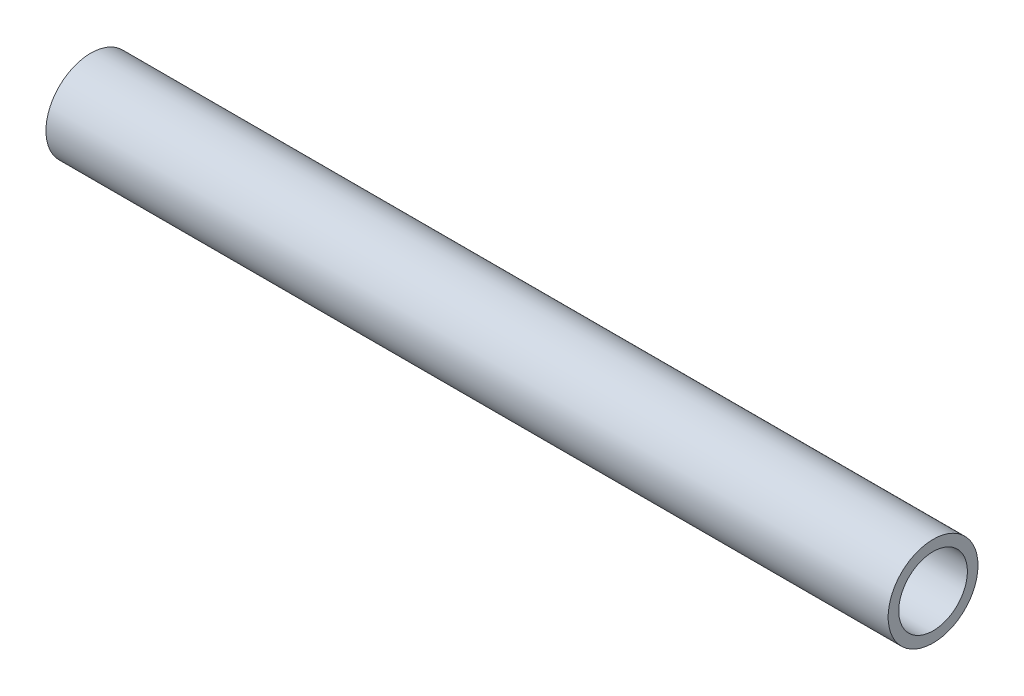
ISO-10303-21;
HEADER;
FILE_DESCRIPTION(('STEP AP214'),'2;1');
FILE_NAME('part.step','',(''),(''),'','','');
FILE_SCHEMA(('AUTOMOTIVE_DESIGN { 1 0 10303 214 1 1 1 1 }'));
ENDSEC;
DATA;
#1=APPLICATION_CONTEXT('core data for automotive mechanical design processes');
#2=APPLICATION_PROTOCOL_DEFINITION('international standard','automotive_design',2000,#1);
#3=PRODUCT_CONTEXT('',#1,'mechanical');
#4=PRODUCT('Part','Part','',(#3));
#5=PRODUCT_RELATED_PRODUCT_CATEGORY('part','',(#4));
#6=PRODUCT_DEFINITION_FORMATION('','',#4);
#7=PRODUCT_DEFINITION_CONTEXT('part definition',#1,'design');
#8=PRODUCT_DEFINITION('design','',#6,#7);
#9=PRODUCT_DEFINITION_SHAPE('','',#8);
#10=(LENGTH_UNIT() NAMED_UNIT(*) SI_UNIT(.MILLI.,.METRE.));
#11=(NAMED_UNIT(*) PLANE_ANGLE_UNIT() SI_UNIT($,.RADIAN.));
#12=(NAMED_UNIT(*) SI_UNIT($,.STERADIAN.) SOLID_ANGLE_UNIT());
#13=UNCERTAINTY_MEASURE_WITH_UNIT(LENGTH_MEASURE(1.E-05),#10,'distance_accuracy_value','');
#14=(GEOMETRIC_REPRESENTATION_CONTEXT(3) GLOBAL_UNCERTAINTY_ASSIGNED_CONTEXT((#13)) GLOBAL_UNIT_ASSIGNED_CONTEXT((#10,
#11,#12)) REPRESENTATION_CONTEXT('',''));
#15=CARTESIAN_POINT('',(0.,0.,0.));
#16=DIRECTION('',(0.,0.,1.));
#17=DIRECTION('',(1.,0.,0.));
#18=AXIS2_PLACEMENT_3D('',#15,#16,#17);
#19=CARTESIAN_POINT('',(150.,0.,0.));
#20=DIRECTION('',(1.,0.,0.));
#21=DIRECTION('',(0.,0.,-1.));
#22=AXIS2_PLACEMENT_3D('',#19,#20,#21);
#23=PLANE('',#22);
#24=CARTESIAN_POINT('',(150.,0.,0.));
#25=DIRECTION('',(1.,0.,0.));
#26=DIRECTION('',(0.,0.,-1.));
#27=AXIS2_PLACEMENT_3D('',#24,#25,#26);
#28=CIRCLE('',#27,8.);
#29=CARTESIAN_POINT('',(150.,0.,-8.));
#30=VERTEX_POINT('',#29);
#31=EDGE_CURVE('E10',#30,#30,#28,.T.);
#32=ORIENTED_EDGE('',*,*,#31,.T.);
#33=EDGE_LOOP('',(#32));
#34=FACE_BOUND('',#33,.T.);
#35=CARTESIAN_POINT('',(150.,0.,0.));
#36=DIRECTION('',(1.,0.,0.));
#37=DIRECTION('',(0.,0.,-1.));
#38=AXIS2_PLACEMENT_3D('',#35,#36,#37);
#39=CIRCLE('',#38,6.1147678504897);
#40=CARTESIAN_POINT('',(150.,0.,-6.1147678504897));
#41=VERTEX_POINT('',#40);
#42=EDGE_CURVE('E54',#41,#41,#39,.T.);
#43=ORIENTED_EDGE('',*,*,#42,.F.);
#44=EDGE_LOOP('',(#43));
#45=FACE_BOUND('',#44,.T.);
#46=ADVANCED_FACE('F41',(#34,#45),#23,.T.);
#47=CARTESIAN_POINT('',(0.,0.,0.));
#48=DIRECTION('',(1.,0.,0.));
#49=DIRECTION('',(0.,0.,-1.));
#50=AXIS2_PLACEMENT_3D('',#47,#48,#49);
#51=PLANE('',#50);
#52=CARTESIAN_POINT('',(0.,0.,0.));
#53=DIRECTION('',(1.,0.,0.));
#54=DIRECTION('',(0.,0.,-1.));
#55=AXIS2_PLACEMENT_3D('',#52,#53,#54);
#56=CIRCLE('',#55,8.);
#57=CARTESIAN_POINT('',(0.,0.,-8.));
#58=VERTEX_POINT('',#57);
#59=EDGE_CURVE('E45',#58,#58,#56,.T.);
#60=ORIENTED_EDGE('',*,*,#59,.F.);
#61=EDGE_LOOP('',(#60));
#62=FACE_BOUND('',#61,.T.);
#63=CARTESIAN_POINT('',(0.,0.,0.));
#64=DIRECTION('',(1.,0.,0.));
#65=DIRECTION('',(0.,0.,-1.));
#66=AXIS2_PLACEMENT_3D('',#63,#64,#65);
#67=CIRCLE('',#66,6.1147678504897);
#68=CARTESIAN_POINT('',(0.,0.,-6.1147678504897));
#69=VERTEX_POINT('',#68);
#70=EDGE_CURVE('E56',#69,#69,#67,.T.);
#71=ORIENTED_EDGE('',*,*,#70,.T.);
#72=EDGE_LOOP('',(#71));
#73=FACE_BOUND('',#72,.T.);
#74=ADVANCED_FACE('F68',(#62,#73),#51,.F.);
#75=CARTESIAN_POINT('',(150.,0.,0.));
#76=DIRECTION('',(-1.,0.,0.));
#77=DIRECTION('',(0.,0.,1.));
#78=AXIS2_PLACEMENT_3D('',#75,#76,#77);
#79=CYLINDRICAL_SURFACE('',#78,8.);
#80=ORIENTED_EDGE('',*,*,#31,.F.);
#81=EDGE_LOOP('',(#80));
#82=FACE_BOUND('',#81,.T.);
#83=ORIENTED_EDGE('',*,*,#59,.T.);
#84=EDGE_LOOP('',(#83));
#85=FACE_BOUND('',#84,.T.);
#86=ADVANCED_FACE('F43',(#82,#85),#79,.T.);
#87=CARTESIAN_POINT('',(150.,0.,0.));
#88=DIRECTION('',(-1.,0.,0.));
#89=DIRECTION('',(0.,0.,1.));
#90=AXIS2_PLACEMENT_3D('',#87,#88,#89);
#91=CYLINDRICAL_SURFACE('',#90,6.1147678504897);
#92=ORIENTED_EDGE('',*,*,#42,.T.);
#93=EDGE_LOOP('',(#92));
#94=FACE_BOUND('',#93,.T.);
#95=ORIENTED_EDGE('',*,*,#70,.F.);
#96=EDGE_LOOP('',(#95));
#97=FACE_BOUND('',#96,.T.);
#98=ADVANCED_FACE('F64',(#94,#97),#91,.F.);
#99=CLOSED_SHELL('',(#46,#74,#86,#98));
#100=MANIFOLD_SOLID_BREP('B2',#99);
#101=ADVANCED_BREP_SHAPE_REPRESENTATION('',(#18,#100),#14);
#102=SHAPE_DEFINITION_REPRESENTATION(#9,#101);
ENDSEC;
END-ISO-10303-21;
